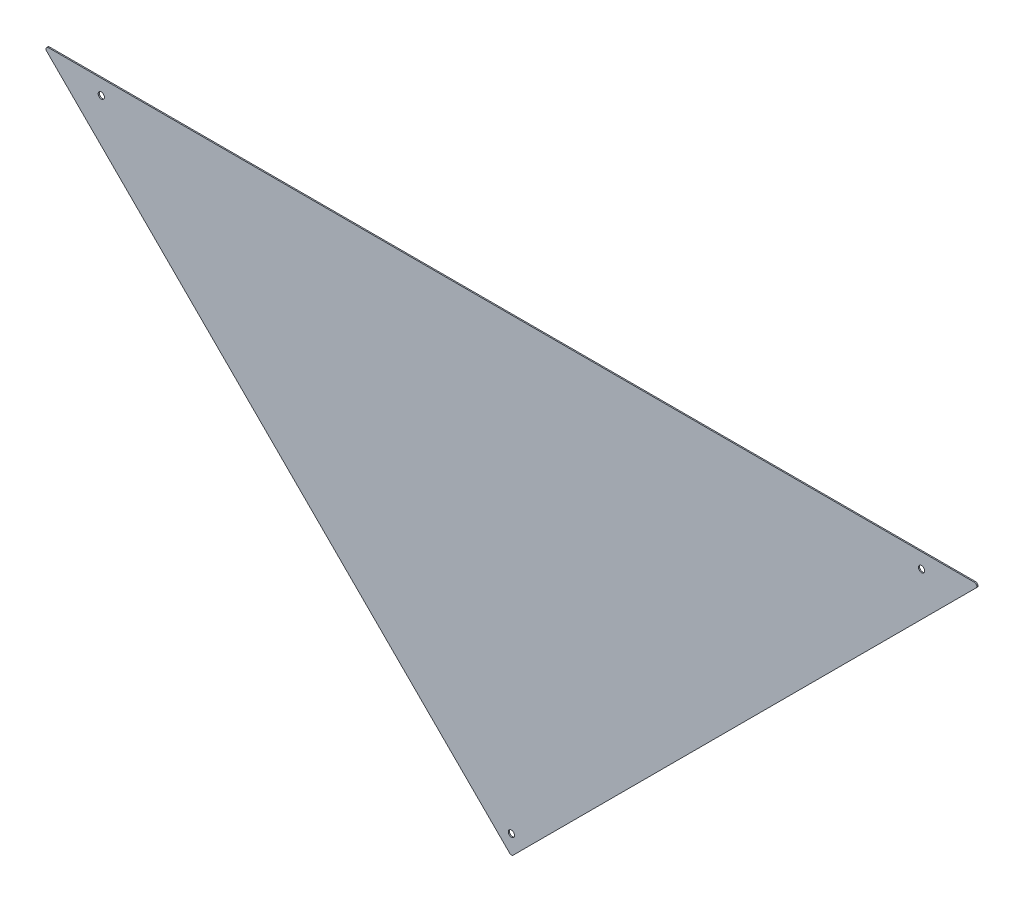
ISO-10303-21;
HEADER;
FILE_DESCRIPTION(('STEP AP214'),'2;1');
FILE_NAME('part.step','',(''),(''),'','','');
FILE_SCHEMA(('AUTOMOTIVE_DESIGN { 1 0 10303 214 1 1 1 1 }'));
ENDSEC;
DATA;
#1=APPLICATION_CONTEXT('core data for automotive mechanical design processes');
#2=APPLICATION_PROTOCOL_DEFINITION('international standard','automotive_design',2000,#1);
#3=PRODUCT_CONTEXT('',#1,'mechanical');
#4=PRODUCT('Part','Part','',(#3));
#5=PRODUCT_RELATED_PRODUCT_CATEGORY('part','',(#4));
#6=PRODUCT_DEFINITION_FORMATION('','',#4);
#7=PRODUCT_DEFINITION_CONTEXT('part definition',#1,'design');
#8=PRODUCT_DEFINITION('design','',#6,#7);
#9=PRODUCT_DEFINITION_SHAPE('','',#8);
#10=(LENGTH_UNIT() NAMED_UNIT(*) SI_UNIT(.MILLI.,.METRE.));
#11=(NAMED_UNIT(*) PLANE_ANGLE_UNIT() SI_UNIT($,.RADIAN.));
#12=(NAMED_UNIT(*) SI_UNIT($,.STERADIAN.) SOLID_ANGLE_UNIT());
#13=UNCERTAINTY_MEASURE_WITH_UNIT(LENGTH_MEASURE(1.E-05),#10,'distance_accuracy_value','');
#14=(GEOMETRIC_REPRESENTATION_CONTEXT(3) GLOBAL_UNCERTAINTY_ASSIGNED_CONTEXT((#13)) GLOBAL_UNIT_ASSIGNED_CONTEXT((#10,
#11,#12)) REPRESENTATION_CONTEXT('',''));
#15=CARTESIAN_POINT('',(0.,0.,0.));
#16=DIRECTION('',(0.,0.,1.));
#17=DIRECTION('',(1.,0.,0.));
#18=AXIS2_PLACEMENT_3D('',#15,#16,#17);
#19=CARTESIAN_POINT('',(0.,0.,0.));
#20=DIRECTION('',(0.,0.,1.));
#21=DIRECTION('',(1.,0.,0.));
#22=AXIS2_PLACEMENT_3D('',#19,#20,#21);
#23=PLANE('',#22);
#24=DIRECTION('',(-0.707106781186548,0.707106781186547,0.));
#25=VECTOR('',#24,1.);
#26=CARTESIAN_POINT('',(2.12132034355968,2.12132034355968,0.));
#27=LINE('',#26,#25);
#28=CARTESIAN_POINT('',(-2.12132034355,6.36396103066937,0.));
#29=VERTEX_POINT('',#28);
#30=CARTESIAN_POINT('',(-594.878679656431,599.12132034355,0.));
#31=VERTEX_POINT('',#30);
#32=EDGE_CURVE('E70',#29,#31,#27,.T.);
#33=ORIENTED_EDGE('',*,*,#32,.T.);
#34=CARTESIAN_POINT('',(-592.757359312871,601.24264068711,0.));
#35=DIRECTION('',(0.,0.,-1.));
#36=DIRECTION('',(-1.,0.,0.));
#37=AXIS2_PLACEMENT_3D('',#34,#35,#36);
#38=CIRCLE('',#37,2.99999999999989);
#39=CARTESIAN_POINT('',(-592.757359312871,604.242640687109,0.));
#40=VERTEX_POINT('',#39);
#41=EDGE_CURVE('E116',#40,#31,#38,.F.);
#42=ORIENTED_EDGE('',*,*,#41,.F.);
#43=DIRECTION('',(1.,0.,0.));
#44=VECTOR('',#43,1.);
#45=CARTESIAN_POINT('',(-1.13173473363328E-13,604.24264068711,0.));
#46=LINE('',#45,#44);
#47=CARTESIAN_POINT('',(592.75735931289,604.24264068711,0.));
#48=VERTEX_POINT('',#47);
#49=EDGE_CURVE('E97',#40,#48,#46,.T.);
#50=ORIENTED_EDGE('',*,*,#49,.T.);
#51=CARTESIAN_POINT('',(592.75735931289,601.24264068711,0.));
#52=DIRECTION('',(0.,0.,-1.));
#53=DIRECTION('',(-1.,0.,0.));
#54=AXIS2_PLACEMENT_3D('',#51,#52,#53);
#55=CIRCLE('',#54,3.);
#56=CARTESIAN_POINT('',(594.87867965645,599.12132034355,0.));
#57=VERTEX_POINT('',#56);
#58=EDGE_CURVE('E103',#57,#48,#55,.F.);
#59=ORIENTED_EDGE('',*,*,#58,.F.);
#60=DIRECTION('',(-0.707106781186547,-0.707106781186548,0.));
#61=VECTOR('',#60,1.);
#62=CARTESIAN_POINT('',(-2.12132034355001,2.12132034355001,0.));
#63=LINE('',#62,#61);
#64=CARTESIAN_POINT('',(2.12132034356932,6.36396103066933,0.));
#65=VERTEX_POINT('',#64);
#66=EDGE_CURVE('E73',#57,#65,#63,.T.);
#67=ORIENTED_EDGE('',*,*,#66,.T.);
#68=CARTESIAN_POINT('',(9.65894031423886E-12,8.48528137422899,0.));
#69=DIRECTION('',(0.,0.,-1.));
#70=DIRECTION('',(-1.,0.,0.));
#71=AXIS2_PLACEMENT_3D('',#68,#69,#70);
#72=CIRCLE('',#71,2.99999999999999);
#73=EDGE_CURVE('E66',#29,#65,#72,.F.);
#74=ORIENTED_EDGE('',*,*,#73,.F.);
#75=EDGE_LOOP('',(#33,#42,#50,#59,#67,#74));
#76=FACE_BOUND('',#75,.T.);
#77=CARTESIAN_POINT('',(-525.000000000019,585.,0.));
#78=DIRECTION('',(0.,0.,-1.));
#79=DIRECTION('',(-1.,0.,0.));
#80=AXIS2_PLACEMENT_3D('',#77,#78,#79);
#81=CIRCLE('',#80,4.);
#82=CARTESIAN_POINT('',(-529.000000000019,585.,0.));
#83=VERTEX_POINT('',#82);
#84=EDGE_CURVE('E77',#83,#83,#81,.F.);
#85=ORIENTED_EDGE('',*,*,#84,.T.);
#86=EDGE_LOOP('',(#85));
#87=FACE_BOUND('',#86,.T.);
#88=CARTESIAN_POINT('',(525.000000000019,585.000000000001,0.));
#89=DIRECTION('',(0.,0.,-1.));
#90=DIRECTION('',(-1.,0.,0.));
#91=AXIS2_PLACEMENT_3D('',#88,#89,#90);
#92=CIRCLE('',#91,4.);
#93=CARTESIAN_POINT('',(521.000000000019,585.000000000001,0.));
#94=VERTEX_POINT('',#93);
#95=EDGE_CURVE('E121',#94,#94,#92,.F.);
#96=ORIENTED_EDGE('',*,*,#95,.T.);
#97=EDGE_LOOP('',(#96));
#98=FACE_BOUND('',#97,.T.);
#99=CARTESIAN_POINT('',(-2.49800180540661E-13,29.2426406871193,0.));
#100=DIRECTION('',(0.,0.,-1.));
#101=DIRECTION('',(-1.,0.,0.));
#102=AXIS2_PLACEMENT_3D('',#99,#100,#101);
#103=CIRCLE('',#102,4.);
#104=CARTESIAN_POINT('',(-4.00000000000025,29.2426406871193,0.));
#105=VERTEX_POINT('',#104);
#106=EDGE_CURVE('E19',#105,#105,#103,.F.);
#107=ORIENTED_EDGE('',*,*,#106,.T.);
#108=EDGE_LOOP('',(#107));
#109=FACE_BOUND('',#108,.T.);
#110=ADVANCED_FACE('F16',(#76,#87,#98,#109),#23,.F.);
#111=CARTESIAN_POINT('',(-2.49800180540661E-13,29.2426406871193,1.50000000000006));
#112=DIRECTION('',(0.,0.,-1.));
#113=DIRECTION('',(-1.,0.,0.));
#114=AXIS2_PLACEMENT_3D('',#111,#112,#113);
#115=CYLINDRICAL_SURFACE('',#114,4.);
#116=CARTESIAN_POINT('',(-2.49800180540661E-13,29.2426406871193,1.50000000000006));
#117=DIRECTION('',(0.,0.,-1.));
#118=DIRECTION('',(-1.,0.,0.));
#119=AXIS2_PLACEMENT_3D('',#116,#117,#118);
#120=CIRCLE('',#119,4.);
#121=CARTESIAN_POINT('',(-4.00000000000025,29.2426406871193,1.50000000000006));
#122=VERTEX_POINT('',#121);
#123=EDGE_CURVE('E89',#122,#122,#120,.T.);
#124=ORIENTED_EDGE('',*,*,#123,.F.);
#125=EDGE_LOOP('',(#124));
#126=FACE_BOUND('',#125,.T.);
#127=ORIENTED_EDGE('',*,*,#106,.F.);
#128=EDGE_LOOP('',(#127));
#129=FACE_BOUND('',#128,.T.);
#130=ADVANCED_FACE('F129',(#126,#129),#115,.F.);
#131=CARTESIAN_POINT('',(525.000000000019,585.000000000001,1.50000000000006));
#132=DIRECTION('',(0.,0.,-1.));
#133=DIRECTION('',(-1.,0.,0.));
#134=AXIS2_PLACEMENT_3D('',#131,#132,#133);
#135=CYLINDRICAL_SURFACE('',#134,4.);
#136=CARTESIAN_POINT('',(525.000000000019,585.000000000001,1.50000000000006));
#137=DIRECTION('',(0.,0.,-1.));
#138=DIRECTION('',(-1.,0.,0.));
#139=AXIS2_PLACEMENT_3D('',#136,#137,#138);
#140=CIRCLE('',#139,4.);
#141=CARTESIAN_POINT('',(521.000000000019,585.000000000001,1.50000000000006));
#142=VERTEX_POINT('',#141);
#143=EDGE_CURVE('E92',#142,#142,#140,.T.);
#144=ORIENTED_EDGE('',*,*,#143,.F.);
#145=EDGE_LOOP('',(#144));
#146=FACE_BOUND('',#145,.T.);
#147=ORIENTED_EDGE('',*,*,#95,.F.);
#148=EDGE_LOOP('',(#147));
#149=FACE_BOUND('',#148,.T.);
#150=ADVANCED_FACE('F131',(#146,#149),#135,.F.);
#151=CARTESIAN_POINT('',(-525.000000000019,585.,1.50000000000006));
#152=DIRECTION('',(0.,0.,-1.));
#153=DIRECTION('',(-1.,0.,0.));
#154=AXIS2_PLACEMENT_3D('',#151,#152,#153);
#155=CYLINDRICAL_SURFACE('',#154,4.);
#156=CARTESIAN_POINT('',(-525.000000000019,585.,1.50000000000006));
#157=DIRECTION('',(0.,0.,-1.));
#158=DIRECTION('',(-1.,0.,0.));
#159=AXIS2_PLACEMENT_3D('',#156,#157,#158);
#160=CIRCLE('',#159,4.);
#161=CARTESIAN_POINT('',(-529.000000000019,585.,1.50000000000006));
#162=VERTEX_POINT('',#161);
#163=EDGE_CURVE('E111',#162,#162,#160,.T.);
#164=ORIENTED_EDGE('',*,*,#163,.F.);
#165=EDGE_LOOP('',(#164));
#166=FACE_BOUND('',#165,.T.);
#167=ORIENTED_EDGE('',*,*,#84,.F.);
#168=EDGE_LOOP('',(#167));
#169=FACE_BOUND('',#168,.T.);
#170=ADVANCED_FACE('F138',(#166,#169),#155,.F.);
#171=CARTESIAN_POINT('',(9.65894031423886E-12,8.48528137422899,1.50000000000006));
#172=DIRECTION('',(0.,0.,-1.));
#173=DIRECTION('',(-1.,0.,0.));
#174=AXIS2_PLACEMENT_3D('',#171,#172,#173);
#175=CYLINDRICAL_SURFACE('',#174,2.99999999999999);
#176=CARTESIAN_POINT('',(9.65894031423886E-12,8.48528137422899,1.50000000000006));
#177=DIRECTION('',(0.,0.,-1.));
#178=DIRECTION('',(-1.,0.,0.));
#179=AXIS2_PLACEMENT_3D('',#176,#177,#178);
#180=CIRCLE('',#179,2.99999999999999);
#181=CARTESIAN_POINT('',(-2.12132034355002,6.36396103066935,1.50000000000006));
#182=VERTEX_POINT('',#181);
#183=CARTESIAN_POINT('',(2.12132034356932,6.36396103066933,1.50000000000006));
#184=VERTEX_POINT('',#183);
#185=EDGE_CURVE('E83',#182,#184,#180,.F.);
#186=ORIENTED_EDGE('',*,*,#185,.F.);
#187=DIRECTION('',(0.,0.,1.));
#188=VECTOR('',#187,1.);
#189=CARTESIAN_POINT('',(-2.12132034355002,6.36396103066939,1.50000000000006));
#190=LINE('',#189,#188);
#191=EDGE_CURVE('E80',#182,#29,#190,.F.);
#192=ORIENTED_EDGE('',*,*,#191,.T.);
#193=ORIENTED_EDGE('',*,*,#73,.T.);
#194=DIRECTION('',(0.,0.,1.));
#195=VECTOR('',#194,1.);
#196=CARTESIAN_POINT('',(2.12132034356932,6.36396103066933,1.50000000000006));
#197=LINE('',#196,#195);
#198=EDGE_CURVE('E76',#65,#184,#197,.T.);
#199=ORIENTED_EDGE('',*,*,#198,.T.);
#200=EDGE_LOOP('',(#186,#192,#193,#199));
#201=FACE_BOUND('',#200,.T.);
#202=ADVANCED_FACE('F81',(#201),#175,.T.);
#203=CARTESIAN_POINT('',(-2.12132034355001,2.12132034355001,1.50000000000006));
#204=DIRECTION('',(-0.707106781186548,0.707106781186547,0.));
#205=DIRECTION('',(-0.707106781186547,-0.707106781186548,0.));
#206=AXIS2_PLACEMENT_3D('',#203,#204,#205);
#207=PLANE('',#206);
#208=DIRECTION('',(0.,0.,-1.));
#209=VECTOR('',#208,1.);
#210=CARTESIAN_POINT('',(594.87867965645,599.12132034355,1.50000000000006));
#211=LINE('',#210,#209);
#212=CARTESIAN_POINT('',(594.87867965645,599.12132034355,1.50000000000006));
#213=VERTEX_POINT('',#212);
#214=EDGE_CURVE('E118',#213,#57,#211,.T.);
#215=ORIENTED_EDGE('',*,*,#214,.F.);
#216=DIRECTION('',(0.707106781186547,0.707106781186548,0.));
#217=VECTOR('',#216,1.);
#218=CARTESIAN_POINT('',(2.12132034356932,6.36396103066933,1.50000000000006));
#219=LINE('',#218,#217);
#220=EDGE_CURVE('E109',#184,#213,#219,.T.);
#221=ORIENTED_EDGE('',*,*,#220,.F.);
#222=ORIENTED_EDGE('',*,*,#198,.F.);
#223=ORIENTED_EDGE('',*,*,#66,.F.);
#224=EDGE_LOOP('',(#215,#221,#222,#223));
#225=FACE_BOUND('',#224,.T.);
#226=ADVANCED_FACE('F162',(#225),#207,.F.);
#227=CARTESIAN_POINT('',(592.75735931289,601.24264068711,1.50000000000006));
#228=DIRECTION('',(0.,0.,-1.));
#229=DIRECTION('',(-1.,0.,0.));
#230=AXIS2_PLACEMENT_3D('',#227,#228,#229);
#231=CYLINDRICAL_SURFACE('',#230,3.);
#232=CARTESIAN_POINT('',(592.75735931289,601.24264068711,1.50000000000006));
#233=DIRECTION('',(0.,0.,-1.));
#234=DIRECTION('',(-1.,0.,0.));
#235=AXIS2_PLACEMENT_3D('',#232,#233,#234);
#236=CIRCLE('',#235,3.);
#237=CARTESIAN_POINT('',(592.75735931289,604.24264068711,1.50000000000006));
#238=VERTEX_POINT('',#237);
#239=EDGE_CURVE('E106',#213,#238,#236,.F.);
#240=ORIENTED_EDGE('',*,*,#239,.F.);
#241=ORIENTED_EDGE('',*,*,#214,.T.);
#242=ORIENTED_EDGE('',*,*,#58,.T.);
#243=DIRECTION('',(0.,0.,1.));
#244=VECTOR('',#243,1.);
#245=CARTESIAN_POINT('',(592.75735931289,604.24264068711,1.50000000000006));
#246=LINE('',#245,#244);
#247=EDGE_CURVE('E101',#48,#238,#246,.T.);
#248=ORIENTED_EDGE('',*,*,#247,.T.);
#249=EDGE_LOOP('',(#240,#241,#242,#248));
#250=FACE_BOUND('',#249,.T.);
#251=ADVANCED_FACE('F158',(#250),#231,.T.);
#252=CARTESIAN_POINT('',(-1.13173473363328E-13,604.24264068711,1.50000000000006));
#253=DIRECTION('',(0.,-1.,0.));
#254=DIRECTION('',(1.,0.,0.));
#255=AXIS2_PLACEMENT_3D('',#252,#253,#254);
#256=PLANE('',#255);
#257=DIRECTION('',(0.,0.,-1.));
#258=VECTOR('',#257,1.);
#259=CARTESIAN_POINT('',(-592.757359312871,604.242640687109,1.50000000000006));
#260=LINE('',#259,#258);
#261=CARTESIAN_POINT('',(-592.757359312871,604.24264068711,1.50000000000006));
#262=VERTEX_POINT('',#261);
#263=EDGE_CURVE('E100',#262,#40,#260,.T.);
#264=ORIENTED_EDGE('',*,*,#263,.F.);
#265=DIRECTION('',(1.,0.,0.));
#266=VECTOR('',#265,1.);
#267=CARTESIAN_POINT('',(0.,604.24264068711,1.50000000000006));
#268=LINE('',#267,#266);
#269=EDGE_CURVE('E105',#238,#262,#268,.F.);
#270=ORIENTED_EDGE('',*,*,#269,.F.);
#271=ORIENTED_EDGE('',*,*,#247,.F.);
#272=ORIENTED_EDGE('',*,*,#49,.F.);
#273=EDGE_LOOP('',(#264,#270,#271,#272));
#274=FACE_BOUND('',#273,.T.);
#275=ADVANCED_FACE('F154',(#274),#256,.F.);
#276=CARTESIAN_POINT('',(-592.757359312871,601.24264068711,1.50000000000006));
#277=DIRECTION('',(0.,0.,-1.));
#278=DIRECTION('',(-1.,0.,0.));
#279=AXIS2_PLACEMENT_3D('',#276,#277,#278);
#280=CYLINDRICAL_SURFACE('',#279,2.99999999999989);
#281=ORIENTED_EDGE('',*,*,#41,.T.);
#282=DIRECTION('',(0.,0.,1.));
#283=VECTOR('',#282,1.);
#284=CARTESIAN_POINT('',(-594.878679656431,599.12132034355,1.50000000000006));
#285=LINE('',#284,#283);
#286=CARTESIAN_POINT('',(-594.878679656431,599.12132034355,1.50000000000006));
#287=VERTEX_POINT('',#286);
#288=EDGE_CURVE('E86',#31,#287,#285,.T.);
#289=ORIENTED_EDGE('',*,*,#288,.T.);
#290=CARTESIAN_POINT('',(-592.757359312871,601.24264068711,1.50000000000006));
#291=DIRECTION('',(0.,0.,-1.));
#292=DIRECTION('',(-1.,0.,0.));
#293=AXIS2_PLACEMENT_3D('',#290,#291,#292);
#294=CIRCLE('',#293,2.99999999999989);
#295=EDGE_CURVE('E25',#262,#287,#294,.F.);
#296=ORIENTED_EDGE('',*,*,#295,.F.);
#297=ORIENTED_EDGE('',*,*,#263,.T.);
#298=EDGE_LOOP('',(#281,#289,#296,#297));
#299=FACE_BOUND('',#298,.T.);
#300=ADVANCED_FACE('F148',(#299),#280,.T.);
#301=CARTESIAN_POINT('',(2.12132034355968,2.12132034355968,1.50000000000006));
#302=DIRECTION('',(0.707106781186547,0.707106781186548,0.));
#303=DIRECTION('',(-0.707106781186548,0.707106781186547,0.));
#304=AXIS2_PLACEMENT_3D('',#301,#302,#303);
#305=PLANE('',#304);
#306=ORIENTED_EDGE('',*,*,#191,.F.);
#307=DIRECTION('',(0.707106781186548,-0.707106781186547,0.));
#308=VECTOR('',#307,1.);
#309=CARTESIAN_POINT('',(-594.878679656431,599.12132034355,1.50000000000006));
#310=LINE('',#309,#308);
#311=EDGE_CURVE('E11',#287,#182,#310,.T.);
#312=ORIENTED_EDGE('',*,*,#311,.F.);
#313=ORIENTED_EDGE('',*,*,#288,.F.);
#314=ORIENTED_EDGE('',*,*,#32,.F.);
#315=EDGE_LOOP('',(#306,#312,#313,#314));
#316=FACE_BOUND('',#315,.T.);
#317=ADVANCED_FACE('F88',(#316),#305,.F.);
#318=CARTESIAN_POINT('',(0.,0.,1.50000000000006));
#319=DIRECTION('',(0.,0.,1.));
#320=DIRECTION('',(1.,0.,0.));
#321=AXIS2_PLACEMENT_3D('',#318,#319,#320);
#322=PLANE('',#321);
#323=ORIENTED_EDGE('',*,*,#295,.T.);
#324=ORIENTED_EDGE('',*,*,#311,.T.);
#325=ORIENTED_EDGE('',*,*,#185,.T.);
#326=ORIENTED_EDGE('',*,*,#220,.T.);
#327=ORIENTED_EDGE('',*,*,#239,.T.);
#328=ORIENTED_EDGE('',*,*,#269,.T.);
#329=EDGE_LOOP('',(#323,#324,#325,#326,#327,#328));
#330=FACE_BOUND('',#329,.T.);
#331=ORIENTED_EDGE('',*,*,#163,.T.);
#332=EDGE_LOOP('',(#331));
#333=FACE_BOUND('',#332,.T.);
#334=ORIENTED_EDGE('',*,*,#143,.T.);
#335=EDGE_LOOP('',(#334));
#336=FACE_BOUND('',#335,.T.);
#337=ORIENTED_EDGE('',*,*,#123,.T.);
#338=EDGE_LOOP('',(#337));
#339=FACE_BOUND('',#338,.T.);
#340=ADVANCED_FACE('F142',(#330,#333,#336,#339),#322,.T.);
#341=CLOSED_SHELL('',(#110,#130,#150,#170,#202,#226,#251,#275,#300,#317,#340));
#342=MANIFOLD_SOLID_BREP('B1',#341);
#343=ADVANCED_BREP_SHAPE_REPRESENTATION('',(#18,#342),#14);
#344=SHAPE_DEFINITION_REPRESENTATION(#9,#343);
ENDSEC;
END-ISO-10303-21;
